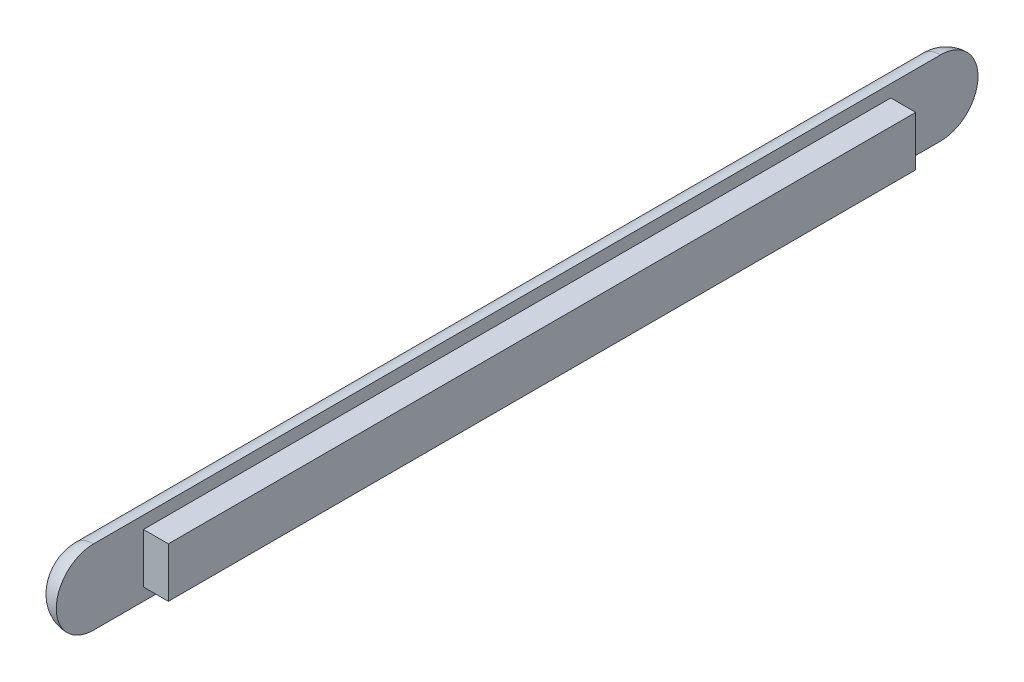
ISO-10303-21;
HEADER;
FILE_DESCRIPTION(('STEP AP214'),'2;1');
FILE_NAME('part.step','',(''),(''),'','','');
FILE_SCHEMA(('AUTOMOTIVE_DESIGN { 1 0 10303 214 1 1 1 1 }'));
ENDSEC;
DATA;
#1=APPLICATION_CONTEXT('core data for automotive mechanical design processes');
#2=APPLICATION_PROTOCOL_DEFINITION('international standard','automotive_design',2000,#1);
#3=PRODUCT_CONTEXT('',#1,'mechanical');
#4=PRODUCT('Part','Part','',(#3));
#5=PRODUCT_RELATED_PRODUCT_CATEGORY('part','',(#4));
#6=PRODUCT_DEFINITION_FORMATION('','',#4);
#7=PRODUCT_DEFINITION_CONTEXT('part definition',#1,'design');
#8=PRODUCT_DEFINITION('design','',#6,#7);
#9=PRODUCT_DEFINITION_SHAPE('','',#8);
#10=(LENGTH_UNIT() NAMED_UNIT(*) SI_UNIT(.MILLI.,.METRE.));
#11=(NAMED_UNIT(*) PLANE_ANGLE_UNIT() SI_UNIT($,.RADIAN.));
#12=(NAMED_UNIT(*) SI_UNIT($,.STERADIAN.) SOLID_ANGLE_UNIT());
#13=UNCERTAINTY_MEASURE_WITH_UNIT(LENGTH_MEASURE(1.E-05),#10,'distance_accuracy_value','');
#14=(GEOMETRIC_REPRESENTATION_CONTEXT(3) GLOBAL_UNCERTAINTY_ASSIGNED_CONTEXT((#13)) GLOBAL_UNIT_ASSIGNED_CONTEXT((#10,
#11,#12)) REPRESENTATION_CONTEXT('',''));
#15=CARTESIAN_POINT('',(0.,0.,0.));
#16=DIRECTION('',(0.,0.,1.));
#17=DIRECTION('',(1.,0.,0.));
#18=AXIS2_PLACEMENT_3D('',#15,#16,#17);
#19=CARTESIAN_POINT('',(10.,-10.,150.));
#20=DIRECTION('',(1.,0.,0.));
#21=DIRECTION('',(0.,0.,-1.));
#22=AXIS2_PLACEMENT_3D('',#19,#20,#21);
#23=PLANE('',#22);
#24=DIRECTION('',(0.,0.,-1.));
#25=VECTOR('',#24,1.);
#26=CARTESIAN_POINT('',(10.,10.,0.));
#27=LINE('',#26,#25);
#28=CARTESIAN_POINT('',(10.,10.,150.));
#29=VERTEX_POINT('',#28);
#30=CARTESIAN_POINT('',(10.,10.,-150.));
#31=VERTEX_POINT('',#30);
#32=EDGE_CURVE('E101',#29,#31,#27,.T.);
#33=ORIENTED_EDGE('',*,*,#32,.F.);
#34=DIRECTION('',(0.,1.,0.));
#35=VECTOR('',#34,1.);
#36=CARTESIAN_POINT('',(10.,0.,150.));
#37=LINE('',#36,#35);
#38=CARTESIAN_POINT('',(10.,-10.,150.));
#39=VERTEX_POINT('',#38);
#40=EDGE_CURVE('E109',#39,#29,#37,.T.);
#41=ORIENTED_EDGE('',*,*,#40,.F.);
#42=DIRECTION('',(0.,0.,-1.));
#43=VECTOR('',#42,1.);
#44=CARTESIAN_POINT('',(10.,-10.,0.));
#45=LINE('',#44,#43);
#46=CARTESIAN_POINT('',(10.,-10.,-150.));
#47=VERTEX_POINT('',#46);
#48=EDGE_CURVE('E117',#39,#47,#45,.T.);
#49=ORIENTED_EDGE('',*,*,#48,.T.);
#50=DIRECTION('',(0.,1.,0.));
#51=VECTOR('',#50,1.);
#52=CARTESIAN_POINT('',(10.,0.,-150.));
#53=LINE('',#52,#51);
#54=EDGE_CURVE('E93',#47,#31,#53,.T.);
#55=ORIENTED_EDGE('',*,*,#54,.T.);
#56=EDGE_LOOP('',(#33,#41,#49,#55));
#57=FACE_BOUND('',#56,.T.);
#58=ADVANCED_FACE('F16',(#57),#23,.T.);
#59=CARTESIAN_POINT('',(0.,-5.,-170.));
#60=DIRECTION('',(0.,0.,1.));
#61=DIRECTION('',(1.,0.,0.));
#62=AXIS2_PLACEMENT_3D('',#59,#60,#61);
#63=CYLINDRICAL_SURFACE('',#62,10.);
#64=DIRECTION('',(0.,0.,-1.));
#65=VECTOR('',#64,1.);
#66=CARTESIAN_POINT('',(0.,-15.,0.));
#67=LINE('',#66,#65);
#68=CARTESIAN_POINT('',(0.,-15.,170.));
#69=VERTEX_POINT('',#68);
#70=CARTESIAN_POINT('',(0.,-15.,-170.));
#71=VERTEX_POINT('',#70);
#72=EDGE_CURVE('E126',#69,#71,#67,.T.);
#73=ORIENTED_EDGE('',*,*,#72,.F.);
#74=CARTESIAN_POINT('',(0.,-5.,170.));
#75=DIRECTION('',(0.,0.,1.));
#76=DIRECTION('',(1.,0.,0.));
#77=AXIS2_PLACEMENT_3D('',#74,#75,#76);
#78=CIRCLE('',#77,10.);
#79=CARTESIAN_POINT('',(-9.99999999999998,-5.,170.));
#80=VERTEX_POINT('',#79);
#81=EDGE_CURVE('E122',#80,#69,#78,.T.);
#82=ORIENTED_EDGE('',*,*,#81,.F.);
#83=DIRECTION('',(0.,0.,-1.));
#84=VECTOR('',#83,1.);
#85=CARTESIAN_POINT('',(-10.,-5.,0.));
#86=LINE('',#85,#84);
#87=CARTESIAN_POINT('',(-10.,-5.,-170.));
#88=VERTEX_POINT('',#87);
#89=EDGE_CURVE('E71',#80,#88,#86,.T.);
#90=ORIENTED_EDGE('',*,*,#89,.T.);
#91=CARTESIAN_POINT('',(0.,-5.,-170.));
#92=DIRECTION('',(0.,0.,-1.));
#93=DIRECTION('',(-1.,0.,0.));
#94=AXIS2_PLACEMENT_3D('',#91,#92,#93);
#95=CIRCLE('',#94,10.);
#96=EDGE_CURVE('E66',#71,#88,#95,.T.);
#97=ORIENTED_EDGE('',*,*,#96,.F.);
#98=EDGE_LOOP('',(#73,#82,#90,#97));
#99=FACE_BOUND('',#98,.T.);
#100=ADVANCED_FACE('F147',(#99),#63,.T.);
#101=CARTESIAN_POINT('',(0.,-10.,-150.));
#102=DIRECTION('',(0.,1.,0.));
#103=DIRECTION('',(0.,0.,1.));
#104=AXIS2_PLACEMENT_3D('',#101,#102,#103);
#105=PLANE('',#104);
#106=DIRECTION('',(1.,0.,0.));
#107=VECTOR('',#106,1.);
#108=CARTESIAN_POINT('',(5.,-10.,-150.));
#109=LINE('',#108,#107);
#110=CARTESIAN_POINT('',(0.,-9.9999999975,-150.00000002947));
#111=VERTEX_POINT('',#110);
#112=EDGE_CURVE('E97',#111,#47,#109,.T.);
#113=ORIENTED_EDGE('',*,*,#112,.T.);
#114=ORIENTED_EDGE('',*,*,#48,.F.);
#115=DIRECTION('',(1.,0.,0.));
#116=VECTOR('',#115,1.);
#117=CARTESIAN_POINT('',(5.,-10.,150.));
#118=LINE('',#117,#116);
#119=CARTESIAN_POINT('',(0.,-9.9999999975,150.00000002947));
#120=VERTEX_POINT('',#119);
#121=EDGE_CURVE('E113',#120,#39,#118,.T.);
#122=ORIENTED_EDGE('',*,*,#121,.F.);
#123=DIRECTION('',(0.,0.,1.));
#124=VECTOR('',#123,1.);
#125=CARTESIAN_POINT('',(0.,-9.99999999,0.));
#126=LINE('',#125,#124);
#127=EDGE_CURVE('E131',#111,#120,#126,.T.);
#128=ORIENTED_EDGE('',*,*,#127,.F.);
#129=EDGE_LOOP('',(#113,#114,#122,#128));
#130=FACE_BOUND('',#129,.T.);
#131=ADVANCED_FACE('F165',(#130),#105,.F.);
#132=CARTESIAN_POINT('',(0.,10.,150.));
#133=DIRECTION('',(0.,0.,1.));
#134=DIRECTION('',(0.,-1.,0.));
#135=AXIS2_PLACEMENT_3D('',#132,#133,#134);
#136=PLANE('',#135);
#137=ORIENTED_EDGE('',*,*,#40,.T.);
#138=DIRECTION('',(1.,0.,0.));
#139=VECTOR('',#138,1.);
#140=CARTESIAN_POINT('',(5.,10.,150.));
#141=LINE('',#140,#139);
#142=CARTESIAN_POINT('',(0.,9.9999999975,150.00000002947));
#143=VERTEX_POINT('',#142);
#144=EDGE_CURVE('E105',#143,#29,#141,.T.);
#145=ORIENTED_EDGE('',*,*,#144,.F.);
#146=DIRECTION('',(0.,1.,0.));
#147=VECTOR('',#146,1.);
#148=CARTESIAN_POINT('',(0.,0.,150.00000011788));
#149=LINE('',#148,#147);
#150=EDGE_CURVE('E136',#120,#143,#149,.T.);
#151=ORIENTED_EDGE('',*,*,#150,.F.);
#152=ORIENTED_EDGE('',*,*,#121,.T.);
#153=EDGE_LOOP('',(#137,#145,#151,#152));
#154=FACE_BOUND('',#153,.T.);
#155=ADVANCED_FACE('F169',(#154),#136,.T.);
#156=CARTESIAN_POINT('',(0.,10.,-150.));
#157=DIRECTION('',(0.,1.,0.));
#158=DIRECTION('',(0.,0.,1.));
#159=AXIS2_PLACEMENT_3D('',#156,#157,#158);
#160=PLANE('',#159);
#161=ORIENTED_EDGE('',*,*,#32,.T.);
#162=DIRECTION('',(-1.,0.,0.));
#163=VECTOR('',#162,1.);
#164=CARTESIAN_POINT('',(5.,10.,-150.));
#165=LINE('',#164,#163);
#166=CARTESIAN_POINT('',(0.,9.9999999975,-150.00000002947));
#167=VERTEX_POINT('',#166);
#168=EDGE_CURVE('E72',#31,#167,#165,.T.);
#169=ORIENTED_EDGE('',*,*,#168,.T.);
#170=DIRECTION('',(0.,0.,-1.));
#171=VECTOR('',#170,1.);
#172=CARTESIAN_POINT('',(0.,9.99999999,0.));
#173=LINE('',#172,#171);
#174=EDGE_CURVE('E176',#143,#167,#173,.T.);
#175=ORIENTED_EDGE('',*,*,#174,.F.);
#176=ORIENTED_EDGE('',*,*,#144,.T.);
#177=EDGE_LOOP('',(#161,#169,#175,#176));
#178=FACE_BOUND('',#177,.T.);
#179=ADVANCED_FACE('F184',(#178),#160,.T.);
#180=CARTESIAN_POINT('',(0.,-10.,-150.));
#181=DIRECTION('',(0.,0.,1.));
#182=DIRECTION('',(1.,0.,0.));
#183=AXIS2_PLACEMENT_3D('',#180,#181,#182);
#184=PLANE('',#183);
#185=ORIENTED_EDGE('',*,*,#168,.F.);
#186=ORIENTED_EDGE('',*,*,#54,.F.);
#187=ORIENTED_EDGE('',*,*,#112,.F.);
#188=DIRECTION('',(0.,-1.,0.));
#189=VECTOR('',#188,1.);
#190=CARTESIAN_POINT('',(0.,0.,-150.00000011788));
#191=LINE('',#190,#189);
#192=EDGE_CURVE('E143',#167,#111,#191,.T.);
#193=ORIENTED_EDGE('',*,*,#192,.F.);
#194=EDGE_LOOP('',(#185,#186,#187,#193));
#195=FACE_BOUND('',#194,.T.);
#196=ADVANCED_FACE('F182',(#195),#184,.F.);
#197=CARTESIAN_POINT('',(0.,0.,-170.));
#198=DIRECTION('',(1.,0.,0.));
#199=DIRECTION('',(0.,0.,-1.));
#200=AXIS2_PLACEMENT_3D('',#197,#198,#199);
#201=DEGENERATE_TOROIDAL_SURFACE('',#200,5.,10.,.T.);
#202=CARTESIAN_POINT('',(0.,5.,-170.));
#203=DIRECTION('',(0.,0.,-1.));
#204=DIRECTION('',(0.,1.,0.));
#205=AXIS2_PLACEMENT_3D('',#202,#203,#204);
#206=CIRCLE('',#205,10.);
#207=CARTESIAN_POINT('',(-9.99999999999997,4.99999997637654,-170.));
#208=VERTEX_POINT('',#207);
#209=CARTESIAN_POINT('',(-8.9793628428733E-10,15.,-170.));
#210=VERTEX_POINT('',#209);
#211=EDGE_CURVE('E64',#208,#210,#206,.T.);
#212=ORIENTED_EDGE('',*,*,#211,.T.);
#213=CARTESIAN_POINT('',(0.,0.,-170.));
#214=DIRECTION('',(1.,0.,0.));
#215=DIRECTION('',(0.,0.,-1.));
#216=AXIS2_PLACEMENT_3D('',#213,#214,#215);
#217=CIRCLE('',#216,15.);
#218=EDGE_CURVE('E129',#71,#210,#217,.T.);
#219=ORIENTED_EDGE('',*,*,#218,.F.);
#220=ORIENTED_EDGE('',*,*,#96,.T.);
#221=CARTESIAN_POINT('',(-9.99999999999997,0.,-170.));
#222=DIRECTION('',(1.,0.,0.));
#223=DIRECTION('',(0.,0.,-1.));
#224=AXIS2_PLACEMENT_3D('',#221,#222,#223);
#225=CIRCLE('',#224,4.99999991319999);
#226=EDGE_CURVE('E20',#88,#208,#225,.T.);
#227=ORIENTED_EDGE('',*,*,#226,.T.);
#228=EDGE_LOOP('',(#212,#219,#220,#227));
#229=FACE_BOUND('',#228,.T.);
#230=ADVANCED_FACE('F62',(#229),#201,.T.);
#231=CARTESIAN_POINT('',(-10.,-5.,177.1));
#232=DIRECTION('',(1.,0.,0.));
#233=DIRECTION('',(0.,0.,-1.));
#234=AXIS2_PLACEMENT_3D('',#231,#232,#233);
#235=PLANE('',#234);
#236=ORIENTED_EDGE('',*,*,#89,.F.);
#237=CARTESIAN_POINT('',(-10.,0.,170.));
#238=DIRECTION('',(1.,0.,0.));
#239=DIRECTION('',(0.,0.,-1.));
#240=AXIS2_PLACEMENT_3D('',#237,#238,#239);
#241=CIRCLE('',#240,5.00000000000005);
#242=CARTESIAN_POINT('',(-10.,4.99999999807655,170.));
#243=VERTEX_POINT('',#242);
#244=EDGE_CURVE('E76',#243,#80,#241,.T.);
#245=ORIENTED_EDGE('',*,*,#244,.F.);
#246=DIRECTION('',(0.,0.,1.));
#247=VECTOR('',#246,1.);
#248=CARTESIAN_POINT('',(-10.,4.9999999961531,0.));
#249=LINE('',#248,#247);
#250=EDGE_CURVE('E74',#243,#208,#249,.F.);
#251=ORIENTED_EDGE('',*,*,#250,.T.);
#252=ORIENTED_EDGE('',*,*,#226,.F.);
#253=EDGE_LOOP('',(#236,#245,#251,#252));
#254=FACE_BOUND('',#253,.T.);
#255=ADVANCED_FACE('F75',(#254),#235,.F.);
#256=CARTESIAN_POINT('',(0.,-15.,187.22));
#257=DIRECTION('',(1.,0.,0.));
#258=DIRECTION('',(0.,0.,-1.));
#259=AXIS2_PLACEMENT_3D('',#256,#257,#258);
#260=PLANE('',#259);
#261=ORIENTED_EDGE('',*,*,#174,.T.);
#262=ORIENTED_EDGE('',*,*,#192,.T.);
#263=ORIENTED_EDGE('',*,*,#127,.T.);
#264=ORIENTED_EDGE('',*,*,#150,.T.);
#265=EDGE_LOOP('',(#261,#262,#263,#264));
#266=FACE_BOUND('',#265,.T.);
#267=ORIENTED_EDGE('',*,*,#72,.T.);
#268=ORIENTED_EDGE('',*,*,#218,.T.);
#269=DIRECTION('',(0.,0.,-1.));
#270=VECTOR('',#269,1.);
#271=CARTESIAN_POINT('',(-1.79587256857466E-09,15.,0.));
#272=LINE('',#271,#270);
#273=CARTESIAN_POINT('',(-8.9793628428733E-10,15.,170.));
#274=VERTEX_POINT('',#273);
#275=EDGE_CURVE('E36',#210,#274,#272,.F.);
#276=ORIENTED_EDGE('',*,*,#275,.T.);
#277=CARTESIAN_POINT('',(0.,0.,170.));
#278=DIRECTION('',(1.,0.,0.));
#279=DIRECTION('',(0.,0.,-1.));
#280=AXIS2_PLACEMENT_3D('',#277,#278,#279);
#281=CIRCLE('',#280,15.);
#282=EDGE_CURVE('E27',#69,#274,#281,.F.);
#283=ORIENTED_EDGE('',*,*,#282,.F.);
#284=EDGE_LOOP('',(#267,#268,#276,#283));
#285=FACE_BOUND('',#284,.T.);
#286=ADVANCED_FACE('F178',(#266,#285),#260,.T.);
#287=CARTESIAN_POINT('',(0.,5.,170.));
#288=DIRECTION('',(0.,0.,-1.));
#289=DIRECTION('',(-1.,0.,0.));
#290=AXIS2_PLACEMENT_3D('',#287,#288,#289);
#291=CYLINDRICAL_SURFACE('',#290,10.);
#292=ORIENTED_EDGE('',*,*,#250,.F.);
#293=CARTESIAN_POINT('',(0.,5.,170.));
#294=DIRECTION('',(0.,0.,1.));
#295=DIRECTION('',(1.,0.,0.));
#296=AXIS2_PLACEMENT_3D('',#293,#294,#295);
#297=CIRCLE('',#296,10.);
#298=EDGE_CURVE('E11',#274,#243,#297,.T.);
#299=ORIENTED_EDGE('',*,*,#298,.F.);
#300=ORIENTED_EDGE('',*,*,#275,.F.);
#301=ORIENTED_EDGE('',*,*,#211,.F.);
#302=EDGE_LOOP('',(#292,#299,#300,#301));
#303=FACE_BOUND('',#302,.T.);
#304=ADVANCED_FACE('F80',(#303),#291,.T.);
#305=CARTESIAN_POINT('',(0.,0.,170.));
#306=DIRECTION('',(1.,0.,0.));
#307=DIRECTION('',(0.,0.,-1.));
#308=AXIS2_PLACEMENT_3D('',#305,#306,#307);
#309=DEGENERATE_TOROIDAL_SURFACE('',#308,5.00000000000005,10.,.T.);
#310=ORIENTED_EDGE('',*,*,#282,.T.);
#311=ORIENTED_EDGE('',*,*,#298,.T.);
#312=ORIENTED_EDGE('',*,*,#244,.T.);
#313=ORIENTED_EDGE('',*,*,#81,.T.);
#314=EDGE_LOOP('',(#310,#311,#312,#313));
#315=FACE_BOUND('',#314,.T.);
#316=ADVANCED_FACE('F18',(#315),#309,.T.);
#317=CLOSED_SHELL('',(#58,#100,#131,#155,#179,#196,#230,#255,#286,#304,#316));
#318=MANIFOLD_SOLID_BREP('B1',#317);
#319=ADVANCED_BREP_SHAPE_REPRESENTATION('',(#18,#318),#14);
#320=SHAPE_DEFINITION_REPRESENTATION(#9,#319);
ENDSEC;
END-ISO-10303-21;
